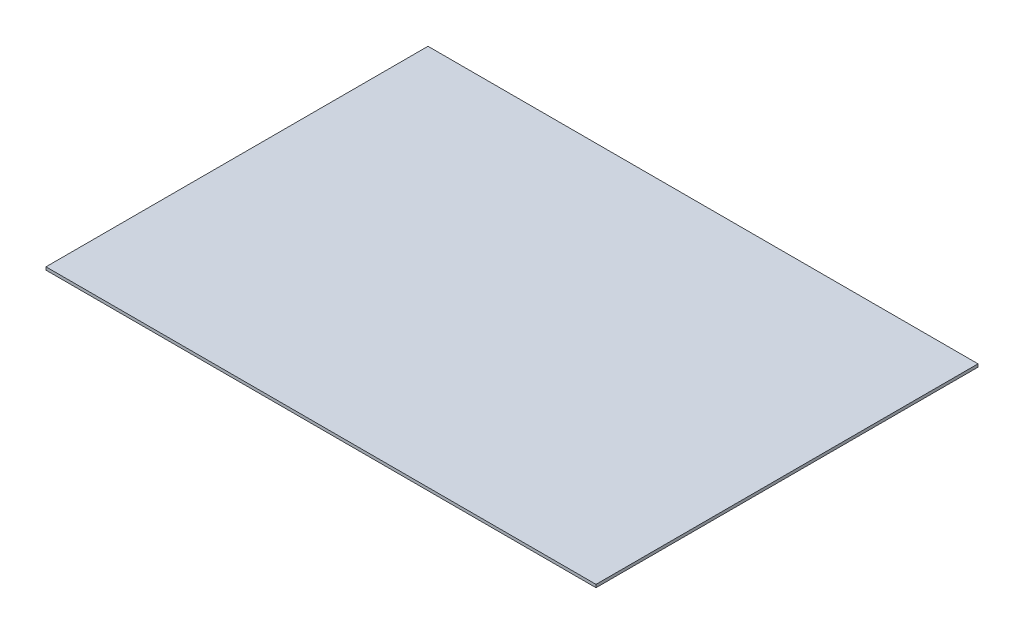
ISO-10303-21;
HEADER;
FILE_DESCRIPTION(('STEP AP214'),'2;1');
FILE_NAME('part.step','',(''),(''),'','','');
FILE_SCHEMA(('AUTOMOTIVE_DESIGN { 1 0 10303 214 1 1 1 1 }'));
ENDSEC;
DATA;
#1=APPLICATION_CONTEXT('core data for automotive mechanical design processes');
#2=APPLICATION_PROTOCOL_DEFINITION('international standard','automotive_design',2000,#1);
#3=PRODUCT_CONTEXT('',#1,'mechanical');
#4=PRODUCT('Part','Part','',(#3));
#5=PRODUCT_RELATED_PRODUCT_CATEGORY('part','',(#4));
#6=PRODUCT_DEFINITION_FORMATION('','',#4);
#7=PRODUCT_DEFINITION_CONTEXT('part definition',#1,'design');
#8=PRODUCT_DEFINITION('design','',#6,#7);
#9=PRODUCT_DEFINITION_SHAPE('','',#8);
#10=(LENGTH_UNIT() NAMED_UNIT(*) SI_UNIT(.MILLI.,.METRE.));
#11=(NAMED_UNIT(*) PLANE_ANGLE_UNIT() SI_UNIT($,.RADIAN.));
#12=(NAMED_UNIT(*) SI_UNIT($,.STERADIAN.) SOLID_ANGLE_UNIT());
#13=UNCERTAINTY_MEASURE_WITH_UNIT(LENGTH_MEASURE(1.E-05),#10,'distance_accuracy_value','');
#14=(GEOMETRIC_REPRESENTATION_CONTEXT(3) GLOBAL_UNCERTAINTY_ASSIGNED_CONTEXT((#13)) GLOBAL_UNIT_ASSIGNED_CONTEXT((#10,
#11,#12)) REPRESENTATION_CONTEXT('',''));
#15=CARTESIAN_POINT('',(0.,0.,0.));
#16=DIRECTION('',(0.,0.,1.));
#17=DIRECTION('',(1.,0.,0.));
#18=AXIS2_PLACEMENT_3D('',#15,#16,#17);
#19=CARTESIAN_POINT('',(0.,0.,390.));
#20=DIRECTION('',(1.,0.,0.));
#21=DIRECTION('',(0.,0.,-1.));
#22=AXIS2_PLACEMENT_3D('',#19,#20,#21);
#23=PLANE('',#22);
#24=DIRECTION('',(0.,-1.,0.));
#25=VECTOR('',#24,1.);
#26=CARTESIAN_POINT('',(0.,0.,0.));
#27=LINE('',#26,#25);
#28=CARTESIAN_POINT('',(0.,3.,0.));
#29=VERTEX_POINT('',#28);
#30=CARTESIAN_POINT('',(0.,0.,0.));
#31=VERTEX_POINT('',#30);
#32=EDGE_CURVE('E101',#29,#31,#27,.T.);
#33=ORIENTED_EDGE('',*,*,#32,.T.);
#34=DIRECTION('',(0.,0.,-1.));
#35=VECTOR('',#34,1.);
#36=CARTESIAN_POINT('',(0.,0.,390.));
#37=LINE('',#36,#35);
#38=CARTESIAN_POINT('',(0.,0.,390.));
#39=VERTEX_POINT('',#38);
#40=EDGE_CURVE('E11',#39,#31,#37,.T.);
#41=ORIENTED_EDGE('',*,*,#40,.F.);
#42=DIRECTION('',(0.,-1.,0.));
#43=VECTOR('',#42,1.);
#44=CARTESIAN_POINT('',(0.,0.,390.));
#45=LINE('',#44,#43);
#46=CARTESIAN_POINT('',(0.,3.,390.));
#47=VERTEX_POINT('',#46);
#48=EDGE_CURVE('E89',#47,#39,#45,.T.);
#49=ORIENTED_EDGE('',*,*,#48,.F.);
#50=DIRECTION('',(0.,0.,-1.));
#51=VECTOR('',#50,1.);
#52=CARTESIAN_POINT('',(0.,3.,390.));
#53=LINE('',#52,#51);
#54=EDGE_CURVE('E97',#47,#29,#53,.T.);
#55=ORIENTED_EDGE('',*,*,#54,.T.);
#56=EDGE_LOOP('',(#33,#41,#49,#55));
#57=FACE_BOUND('',#56,.T.);
#58=ADVANCED_FACE('F38',(#57),#23,.F.);
#59=CARTESIAN_POINT('',(0.,0.,390.));
#60=DIRECTION('',(0.,1.,0.));
#61=DIRECTION('',(0.,0.,1.));
#62=AXIS2_PLACEMENT_3D('',#59,#60,#61);
#63=PLANE('',#62);
#64=DIRECTION('',(1.,0.,0.));
#65=VECTOR('',#64,1.);
#66=CARTESIAN_POINT('',(0.,0.,0.));
#67=LINE('',#66,#65);
#68=CARTESIAN_POINT('',(561.55,0.,0.));
#69=VERTEX_POINT('',#68);
#70=EDGE_CURVE('E93',#31,#69,#67,.T.);
#71=ORIENTED_EDGE('',*,*,#70,.T.);
#72=DIRECTION('',(0.,0.,-1.));
#73=VECTOR('',#72,1.);
#74=CARTESIAN_POINT('',(561.55,0.,390.));
#75=LINE('',#74,#73);
#76=CARTESIAN_POINT('',(561.55,0.,390.));
#77=VERTEX_POINT('',#76);
#78=EDGE_CURVE('E46',#77,#69,#75,.T.);
#79=ORIENTED_EDGE('',*,*,#78,.F.);
#80=DIRECTION('',(1.,0.,0.));
#81=VECTOR('',#80,1.);
#82=CARTESIAN_POINT('',(0.,0.,390.));
#83=LINE('',#82,#81);
#84=EDGE_CURVE('E84',#39,#77,#83,.T.);
#85=ORIENTED_EDGE('',*,*,#84,.F.);
#86=ORIENTED_EDGE('',*,*,#40,.T.);
#87=EDGE_LOOP('',(#71,#79,#85,#86));
#88=FACE_BOUND('',#87,.T.);
#89=ADVANCED_FACE('F92',(#88),#63,.F.);
#90=CARTESIAN_POINT('',(561.55,0.,390.));
#91=DIRECTION('',(-1.,0.,0.));
#92=DIRECTION('',(0.,0.,1.));
#93=AXIS2_PLACEMENT_3D('',#90,#91,#92);
#94=PLANE('',#93);
#95=DIRECTION('',(0.,1.,0.));
#96=VECTOR('',#95,1.);
#97=CARTESIAN_POINT('',(561.55,0.,0.));
#98=LINE('',#97,#96);
#99=CARTESIAN_POINT('',(561.55,3.,0.));
#100=VERTEX_POINT('',#99);
#101=EDGE_CURVE('E71',#69,#100,#98,.T.);
#102=ORIENTED_EDGE('',*,*,#101,.T.);
#103=DIRECTION('',(0.,0.,-1.));
#104=VECTOR('',#103,1.);
#105=CARTESIAN_POINT('',(561.55,3.,390.));
#106=LINE('',#105,#104);
#107=CARTESIAN_POINT('',(561.55,3.,390.));
#108=VERTEX_POINT('',#107);
#109=EDGE_CURVE('E94',#108,#100,#106,.T.);
#110=ORIENTED_EDGE('',*,*,#109,.F.);
#111=DIRECTION('',(0.,1.,0.));
#112=VECTOR('',#111,1.);
#113=CARTESIAN_POINT('',(561.55,0.,390.));
#114=LINE('',#113,#112);
#115=EDGE_CURVE('E87',#77,#108,#114,.T.);
#116=ORIENTED_EDGE('',*,*,#115,.F.);
#117=ORIENTED_EDGE('',*,*,#78,.T.);
#118=EDGE_LOOP('',(#102,#110,#116,#117));
#119=FACE_BOUND('',#118,.T.);
#120=ADVANCED_FACE('F95',(#119),#94,.F.);
#121=CARTESIAN_POINT('',(0.,3.,390.));
#122=DIRECTION('',(0.,-1.,0.));
#123=DIRECTION('',(1.,0.,0.));
#124=AXIS2_PLACEMENT_3D('',#121,#122,#123);
#125=PLANE('',#124);
#126=DIRECTION('',(-1.,0.,0.));
#127=VECTOR('',#126,1.);
#128=CARTESIAN_POINT('',(0.,3.,0.));
#129=LINE('',#128,#127);
#130=EDGE_CURVE('E77',#100,#29,#129,.T.);
#131=ORIENTED_EDGE('',*,*,#130,.T.);
#132=ORIENTED_EDGE('',*,*,#54,.F.);
#133=DIRECTION('',(-1.,0.,0.));
#134=VECTOR('',#133,1.);
#135=CARTESIAN_POINT('',(0.,3.,390.));
#136=LINE('',#135,#134);
#137=EDGE_CURVE('E54',#108,#47,#136,.T.);
#138=ORIENTED_EDGE('',*,*,#137,.F.);
#139=ORIENTED_EDGE('',*,*,#109,.T.);
#140=EDGE_LOOP('',(#131,#132,#138,#139));
#141=FACE_BOUND('',#140,.T.);
#142=ADVANCED_FACE('F108',(#141),#125,.F.);
#143=CARTESIAN_POINT('',(0.,0.,390.));
#144=DIRECTION('',(0.,0.,-1.));
#145=DIRECTION('',(-1.,0.,0.));
#146=AXIS2_PLACEMENT_3D('',#143,#144,#145);
#147=PLANE('',#146);
#148=ORIENTED_EDGE('',*,*,#48,.T.);
#149=ORIENTED_EDGE('',*,*,#84,.T.);
#150=ORIENTED_EDGE('',*,*,#115,.T.);
#151=ORIENTED_EDGE('',*,*,#137,.T.);
#152=EDGE_LOOP('',(#148,#149,#150,#151));
#153=FACE_BOUND('',#152,.T.);
#154=ADVANCED_FACE('F85',(#153),#147,.F.);
#155=CARTESIAN_POINT('',(0.,0.,0.));
#156=DIRECTION('',(0.,0.,-1.));
#157=DIRECTION('',(-1.,0.,0.));
#158=AXIS2_PLACEMENT_3D('',#155,#156,#157);
#159=PLANE('',#158);
#160=ORIENTED_EDGE('',*,*,#32,.F.);
#161=ORIENTED_EDGE('',*,*,#130,.F.);
#162=ORIENTED_EDGE('',*,*,#101,.F.);
#163=ORIENTED_EDGE('',*,*,#70,.F.);
#164=EDGE_LOOP('',(#160,#161,#162,#163));
#165=FACE_BOUND('',#164,.T.);
#166=ADVANCED_FACE('F111',(#165),#159,.T.);
#167=CLOSED_SHELL('',(#58,#89,#120,#142,#154,#166));
#168=MANIFOLD_SOLID_BREP('B2',#167);
#169=ADVANCED_BREP_SHAPE_REPRESENTATION('',(#18,#168),#14);
#170=SHAPE_DEFINITION_REPRESENTATION(#9,#169);
ENDSEC;
END-ISO-10303-21;
